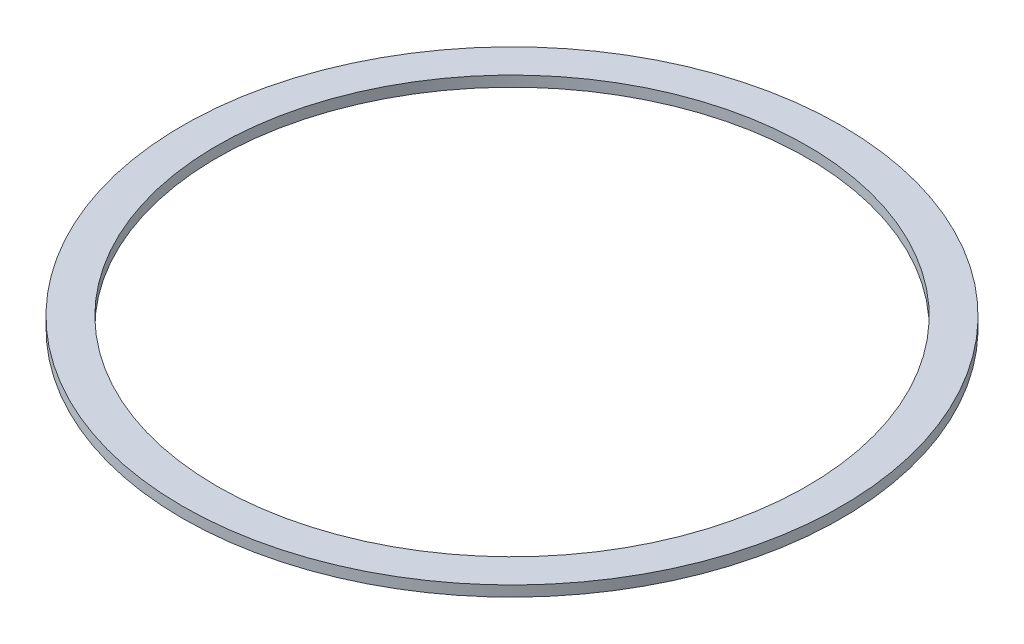
ISO-10303-21;
HEADER;
FILE_DESCRIPTION(('STEP AP214'),'2;1');
FILE_NAME('part.step','',(''),(''),'','','');
FILE_SCHEMA(('AUTOMOTIVE_DESIGN { 1 0 10303 214 1 1 1 1 }'));
ENDSEC;
DATA;
#1=APPLICATION_CONTEXT('core data for automotive mechanical design processes');
#2=APPLICATION_PROTOCOL_DEFINITION('international standard','automotive_design',2000,#1);
#3=PRODUCT_CONTEXT('',#1,'mechanical');
#4=PRODUCT('Part','Part','',(#3));
#5=PRODUCT_RELATED_PRODUCT_CATEGORY('part','',(#4));
#6=PRODUCT_DEFINITION_FORMATION('','',#4);
#7=PRODUCT_DEFINITION_CONTEXT('part definition',#1,'design');
#8=PRODUCT_DEFINITION('design','',#6,#7);
#9=PRODUCT_DEFINITION_SHAPE('','',#8);
#10=(LENGTH_UNIT() NAMED_UNIT(*) SI_UNIT(.MILLI.,.METRE.));
#11=(NAMED_UNIT(*) PLANE_ANGLE_UNIT() SI_UNIT($,.RADIAN.));
#12=(NAMED_UNIT(*) SI_UNIT($,.STERADIAN.) SOLID_ANGLE_UNIT());
#13=UNCERTAINTY_MEASURE_WITH_UNIT(LENGTH_MEASURE(1.E-05),#10,'distance_accuracy_value','');
#14=(GEOMETRIC_REPRESENTATION_CONTEXT(3) GLOBAL_UNCERTAINTY_ASSIGNED_CONTEXT((#13)) GLOBAL_UNIT_ASSIGNED_CONTEXT((#10,
#11,#12)) REPRESENTATION_CONTEXT('',''));
#15=CARTESIAN_POINT('',(0.,0.,0.));
#16=DIRECTION('',(0.,0.,1.));
#17=DIRECTION('',(1.,0.,0.));
#18=AXIS2_PLACEMENT_3D('',#15,#16,#17);
#19=CARTESIAN_POINT('',(0.,3.175,0.));
#20=DIRECTION('',(0.,1.,0.));
#21=DIRECTION('',(0.,0.,1.));
#22=AXIS2_PLACEMENT_3D('',#19,#20,#21);
#23=PLANE('',#22);
#24=CARTESIAN_POINT('',(0.,3.175,0.));
#25=DIRECTION('',(0.,1.,0.));
#26=DIRECTION('',(0.,0.,1.));
#27=AXIS2_PLACEMENT_3D('',#24,#25,#26);
#28=CIRCLE('',#27,99.314);
#29=CARTESIAN_POINT('',(0.,3.175,99.314));
#30=VERTEX_POINT('',#29);
#31=EDGE_CURVE('E10',#30,#30,#28,.T.);
#32=ORIENTED_EDGE('',*,*,#31,.T.);
#33=EDGE_LOOP('',(#32));
#34=FACE_BOUND('',#33,.T.);
#35=CARTESIAN_POINT('',(0.,3.175,0.));
#36=DIRECTION('',(0.,1.,0.));
#37=DIRECTION('',(0.,0.,1.));
#38=AXIS2_PLACEMENT_3D('',#35,#36,#37);
#39=CIRCLE('',#38,88.9);
#40=CARTESIAN_POINT('',(0.,3.175,88.9));
#41=VERTEX_POINT('',#40);
#42=EDGE_CURVE('E45',#41,#41,#39,.T.);
#43=ORIENTED_EDGE('',*,*,#42,.F.);
#44=EDGE_LOOP('',(#43));
#45=FACE_BOUND('',#44,.T.);
#46=ADVANCED_FACE('F34',(#34,#45),#23,.T.);
#47=CARTESIAN_POINT('',(0.,0.,0.));
#48=DIRECTION('',(0.,1.,0.));
#49=DIRECTION('',(0.,0.,1.));
#50=AXIS2_PLACEMENT_3D('',#47,#48,#49);
#51=PLANE('',#50);
#52=CARTESIAN_POINT('',(0.,0.,0.));
#53=DIRECTION('',(0.,1.,0.));
#54=DIRECTION('',(0.,0.,1.));
#55=AXIS2_PLACEMENT_3D('',#52,#53,#54);
#56=CIRCLE('',#55,99.314);
#57=CARTESIAN_POINT('',(0.,0.,99.314));
#58=VERTEX_POINT('',#57);
#59=EDGE_CURVE('E38',#58,#58,#56,.T.);
#60=ORIENTED_EDGE('',*,*,#59,.F.);
#61=EDGE_LOOP('',(#60));
#62=FACE_BOUND('',#61,.T.);
#63=CARTESIAN_POINT('',(0.,0.,0.));
#64=DIRECTION('',(0.,1.,0.));
#65=DIRECTION('',(0.,0.,1.));
#66=AXIS2_PLACEMENT_3D('',#63,#64,#65);
#67=CIRCLE('',#66,88.9);
#68=CARTESIAN_POINT('',(0.,0.,88.9));
#69=VERTEX_POINT('',#68);
#70=EDGE_CURVE('E47',#69,#69,#67,.T.);
#71=ORIENTED_EDGE('',*,*,#70,.T.);
#72=EDGE_LOOP('',(#71));
#73=FACE_BOUND('',#72,.T.);
#74=ADVANCED_FACE('F57',(#62,#73),#51,.F.);
#75=CARTESIAN_POINT('',(0.,3.175,0.));
#76=DIRECTION('',(0.,-1.,0.));
#77=DIRECTION('',(0.,0.,-1.));
#78=AXIS2_PLACEMENT_3D('',#75,#76,#77);
#79=CYLINDRICAL_SURFACE('',#78,99.314);
#80=ORIENTED_EDGE('',*,*,#31,.F.);
#81=EDGE_LOOP('',(#80));
#82=FACE_BOUND('',#81,.T.);
#83=ORIENTED_EDGE('',*,*,#59,.T.);
#84=EDGE_LOOP('',(#83));
#85=FACE_BOUND('',#84,.T.);
#86=ADVANCED_FACE('F36',(#82,#85),#79,.T.);
#87=CARTESIAN_POINT('',(0.,3.175,0.));
#88=DIRECTION('',(0.,-1.,0.));
#89=DIRECTION('',(0.,0.,-1.));
#90=AXIS2_PLACEMENT_3D('',#87,#88,#89);
#91=CYLINDRICAL_SURFACE('',#90,88.9);
#92=ORIENTED_EDGE('',*,*,#42,.T.);
#93=EDGE_LOOP('',(#92));
#94=FACE_BOUND('',#93,.T.);
#95=ORIENTED_EDGE('',*,*,#70,.F.);
#96=EDGE_LOOP('',(#95));
#97=FACE_BOUND('',#96,.T.);
#98=ADVANCED_FACE('F53',(#94,#97),#91,.F.);
#99=CLOSED_SHELL('',(#46,#74,#86,#98));
#100=MANIFOLD_SOLID_BREP('B2',#99);
#101=ADVANCED_BREP_SHAPE_REPRESENTATION('',(#18,#100),#14);
#102=SHAPE_DEFINITION_REPRESENTATION(#9,#101);
ENDSEC;
END-ISO-10303-21;
